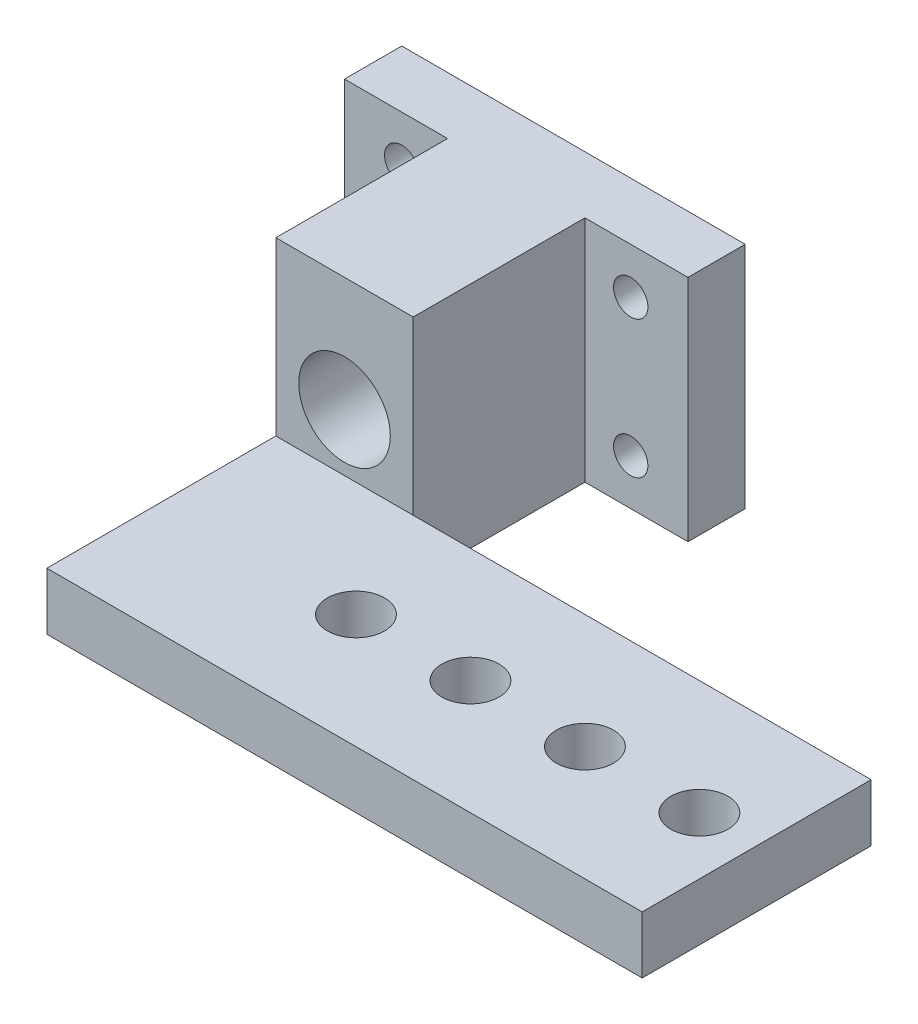
ISO-10303-21;
HEADER;
FILE_DESCRIPTION(('STEP AP214'),'2;1');
FILE_NAME('part.step','',(''),(''),'','','');
FILE_SCHEMA(('AUTOMOTIVE_DESIGN { 1 0 10303 214 1 1 1 1 }'));
ENDSEC;
DATA;
#1=APPLICATION_CONTEXT('core data for automotive mechanical design processes');
#2=APPLICATION_PROTOCOL_DEFINITION('international standard','automotive_design',2000,#1);
#3=PRODUCT_CONTEXT('',#1,'mechanical');
#4=PRODUCT('Part','Part','',(#3));
#5=PRODUCT_RELATED_PRODUCT_CATEGORY('part','',(#4));
#6=PRODUCT_DEFINITION_FORMATION('','',#4);
#7=PRODUCT_DEFINITION_CONTEXT('part definition',#1,'design');
#8=PRODUCT_DEFINITION('design','',#6,#7);
#9=PRODUCT_DEFINITION_SHAPE('','',#8);
#10=(LENGTH_UNIT() NAMED_UNIT(*) SI_UNIT(.MILLI.,.METRE.));
#11=(NAMED_UNIT(*) PLANE_ANGLE_UNIT() SI_UNIT($,.RADIAN.));
#12=(NAMED_UNIT(*) SI_UNIT($,.STERADIAN.) SOLID_ANGLE_UNIT());
#13=UNCERTAINTY_MEASURE_WITH_UNIT(LENGTH_MEASURE(1.E-05),#10,'distance_accuracy_value','');
#14=(GEOMETRIC_REPRESENTATION_CONTEXT(3) GLOBAL_UNCERTAINTY_ASSIGNED_CONTEXT((#13)) GLOBAL_UNIT_ASSIGNED_CONTEXT((#10,
#11,#12)) REPRESENTATION_CONTEXT('',''));
#15=CARTESIAN_POINT('',(0.,0.,0.));
#16=DIRECTION('',(0.,0.,1.));
#17=DIRECTION('',(1.,0.,0.));
#18=AXIS2_PLACEMENT_3D('',#15,#16,#17);
#19=CARTESIAN_POINT('',(21.,0.,5.));
#20=DIRECTION('',(-1.,0.,0.));
#21=DIRECTION('',(0.,-1.,0.));
#22=AXIS2_PLACEMENT_3D('',#19,#20,#21);
#23=PLANE('',#22);
#24=DIRECTION('',(0.,1.,0.));
#25=VECTOR('',#24,1.);
#26=CARTESIAN_POINT('',(21.,-15.,20.));
#27=LINE('',#26,#25);
#28=CARTESIAN_POINT('',(21.,-20.,20.));
#29=VERTEX_POINT('',#28);
#30=CARTESIAN_POINT('',(21.,-15.,20.));
#31=VERTEX_POINT('',#30);
#32=EDGE_CURVE('E146',#29,#31,#27,.T.);
#33=ORIENTED_EDGE('',*,*,#32,.F.);
#34=DIRECTION('',(0.,0.,1.));
#35=VECTOR('',#34,1.);
#36=CARTESIAN_POINT('',(21.,-20.,5.));
#37=LINE('',#36,#35);
#38=CARTESIAN_POINT('',(21.,-20.,5.));
#39=VERTEX_POINT('',#38);
#40=EDGE_CURVE('E178',#39,#29,#37,.T.);
#41=ORIENTED_EDGE('',*,*,#40,.F.);
#42=DIRECTION('',(0.,-1.,0.));
#43=VECTOR('',#42,1.);
#44=CARTESIAN_POINT('',(21.,0.,5.));
#45=LINE('',#44,#43);
#46=CARTESIAN_POINT('',(21.,0.,5.));
#47=VERTEX_POINT('',#46);
#48=EDGE_CURVE('E187',#47,#39,#45,.T.);
#49=ORIENTED_EDGE('',*,*,#48,.F.);
#50=DIRECTION('',(0.,0.,1.));
#51=VECTOR('',#50,1.);
#52=CARTESIAN_POINT('',(21.,0.,5.));
#53=LINE('',#52,#51);
#54=CARTESIAN_POINT('',(21.,0.,20.));
#55=VERTEX_POINT('',#54);
#56=EDGE_CURVE('E192',#47,#55,#53,.T.);
#57=ORIENTED_EDGE('',*,*,#56,.T.);
#58=DIRECTION('',(0.,-1.,0.));
#59=VECTOR('',#58,1.);
#60=CARTESIAN_POINT('',(21.,0.,20.));
#61=LINE('',#60,#59);
#62=EDGE_CURVE('E167',#55,#31,#61,.T.);
#63=ORIENTED_EDGE('',*,*,#62,.T.);
#64=EDGE_LOOP('',(#33,#41,#49,#57,#63));
#65=FACE_BOUND('',#64,.T.);
#66=ADVANCED_FACE('F33',(#65),#23,.F.);
#67=CARTESIAN_POINT('',(0.,0.,20.));
#68=DIRECTION('',(1.,0.,0.));
#69=DIRECTION('',(0.,1.,0.));
#70=AXIS2_PLACEMENT_3D('',#67,#68,#69);
#71=PLANE('',#70);
#72=DIRECTION('',(0.,-1.,0.));
#73=VECTOR('',#72,1.);
#74=CARTESIAN_POINT('',(0.,0.,5.));
#75=LINE('',#74,#73);
#76=CARTESIAN_POINT('',(0.,0.,5.));
#77=VERTEX_POINT('',#76);
#78=CARTESIAN_POINT('',(0.,-20.,5.));
#79=VERTEX_POINT('',#78);
#80=EDGE_CURVE('E168',#77,#79,#75,.T.);
#81=ORIENTED_EDGE('',*,*,#80,.F.);
#82=DIRECTION('',(0.,0.,-1.));
#83=VECTOR('',#82,1.);
#84=CARTESIAN_POINT('',(0.,0.,20.));
#85=LINE('',#84,#83);
#86=CARTESIAN_POINT('',(0.,0.,0.));
#87=VERTEX_POINT('',#86);
#88=EDGE_CURVE('E225',#77,#87,#85,.T.);
#89=ORIENTED_EDGE('',*,*,#88,.T.);
#90=DIRECTION('',(0.,-1.,0.));
#91=VECTOR('',#90,1.);
#92=CARTESIAN_POINT('',(0.,0.,0.));
#93=LINE('',#92,#91);
#94=CARTESIAN_POINT('',(0.,-20.,0.));
#95=VERTEX_POINT('',#94);
#96=EDGE_CURVE('E221',#87,#95,#93,.T.);
#97=ORIENTED_EDGE('',*,*,#96,.T.);
#98=DIRECTION('',(0.,0.,-1.));
#99=VECTOR('',#98,1.);
#100=CARTESIAN_POINT('',(0.,-20.,20.));
#101=LINE('',#100,#99);
#102=EDGE_CURVE('E11',#79,#95,#101,.T.);
#103=ORIENTED_EDGE('',*,*,#102,.F.);
#104=EDGE_LOOP('',(#81,#89,#97,#103));
#105=FACE_BOUND('',#104,.T.);
#106=ADVANCED_FACE('F35',(#105),#71,.F.);
#107=CARTESIAN_POINT('',(5.,-4.,20.));
#108=DIRECTION('',(0.,0.,-1.));
#109=DIRECTION('',(-1.,0.,0.));
#110=AXIS2_PLACEMENT_3D('',#107,#108,#109);
#111=CYLINDRICAL_SURFACE('',#110,1.5);
#112=CARTESIAN_POINT('',(5.,-4.,0.));
#113=DIRECTION('',(0.,0.,1.));
#114=DIRECTION('',(1.,0.,0.));
#115=AXIS2_PLACEMENT_3D('',#112,#113,#114);
#116=CIRCLE('',#115,1.5);
#117=CARTESIAN_POINT('',(6.5,-4.,0.));
#118=VERTEX_POINT('',#117);
#119=EDGE_CURVE('E218',#118,#118,#116,.T.);
#120=ORIENTED_EDGE('',*,*,#119,.F.);
#121=EDGE_LOOP('',(#120));
#122=FACE_BOUND('',#121,.T.);
#123=CARTESIAN_POINT('',(5.,-4.,5.));
#124=DIRECTION('',(0.,0.,1.));
#125=DIRECTION('',(1.,0.,0.));
#126=AXIS2_PLACEMENT_3D('',#123,#124,#125);
#127=CIRCLE('',#126,1.5);
#128=CARTESIAN_POINT('',(6.5,-4.,5.));
#129=VERTEX_POINT('',#128);
#130=EDGE_CURVE('E197',#129,#129,#127,.T.);
#131=ORIENTED_EDGE('',*,*,#130,.T.);
#132=EDGE_LOOP('',(#131));
#133=FACE_BOUND('',#132,.T.);
#134=ADVANCED_FACE('F305',(#122,#133),#111,.F.);
#135=CARTESIAN_POINT('',(5.,-16.,20.));
#136=DIRECTION('',(0.,0.,-1.));
#137=DIRECTION('',(-1.,0.,0.));
#138=AXIS2_PLACEMENT_3D('',#135,#136,#137);
#139=CYLINDRICAL_SURFACE('',#138,1.5);
#140=CARTESIAN_POINT('',(5.,-16.,0.));
#141=DIRECTION('',(0.,0.,1.));
#142=DIRECTION('',(-1.,0.,0.));
#143=AXIS2_PLACEMENT_3D('',#140,#141,#142);
#144=CIRCLE('',#143,1.5);
#145=CARTESIAN_POINT('',(3.5,-16.,0.));
#146=VERTEX_POINT('',#145);
#147=EDGE_CURVE('E207',#146,#146,#144,.T.);
#148=ORIENTED_EDGE('',*,*,#147,.F.);
#149=EDGE_LOOP('',(#148));
#150=FACE_BOUND('',#149,.T.);
#151=CARTESIAN_POINT('',(5.,-16.,5.));
#152=DIRECTION('',(0.,0.,1.));
#153=DIRECTION('',(1.,0.,0.));
#154=AXIS2_PLACEMENT_3D('',#151,#152,#153);
#155=CIRCLE('',#154,1.5);
#156=CARTESIAN_POINT('',(6.5,-16.,5.));
#157=VERTEX_POINT('',#156);
#158=EDGE_CURVE('E182',#157,#157,#155,.T.);
#159=ORIENTED_EDGE('',*,*,#158,.T.);
#160=EDGE_LOOP('',(#159));
#161=FACE_BOUND('',#160,.T.);
#162=ADVANCED_FACE('F243',(#150,#161),#139,.F.);
#163=CARTESIAN_POINT('',(0.,0.,20.));
#164=DIRECTION('',(0.,0.,1.));
#165=DIRECTION('',(1.,0.,0.));
#166=AXIS2_PLACEMENT_3D('',#163,#164,#165);
#167=PLANE('',#166);
#168=DIRECTION('',(-1.,0.,0.));
#169=VECTOR('',#168,1.);
#170=CARTESIAN_POINT('',(9.,-15.,20.));
#171=LINE('',#170,#169);
#172=CARTESIAN_POINT('',(9.,-15.,20.));
#173=VERTEX_POINT('',#172);
#174=EDGE_CURVE('E159',#31,#173,#171,.T.);
#175=ORIENTED_EDGE('',*,*,#174,.F.);
#176=ORIENTED_EDGE('',*,*,#62,.F.);
#177=DIRECTION('',(-1.,0.,0.));
#178=VECTOR('',#177,1.);
#179=CARTESIAN_POINT('',(0.,0.,20.));
#180=LINE('',#179,#178);
#181=CARTESIAN_POINT('',(9.,0.,20.));
#182=VERTEX_POINT('',#181);
#183=EDGE_CURVE('E222',#55,#182,#180,.T.);
#184=ORIENTED_EDGE('',*,*,#183,.T.);
#185=DIRECTION('',(0.,1.,0.));
#186=VECTOR('',#185,1.);
#187=CARTESIAN_POINT('',(9.,0.,20.));
#188=LINE('',#187,#186);
#189=EDGE_CURVE('E171',#173,#182,#188,.T.);
#190=ORIENTED_EDGE('',*,*,#189,.F.);
#191=EDGE_LOOP('',(#175,#176,#184,#190));
#192=FACE_BOUND('',#191,.T.);
#193=CARTESIAN_POINT('',(15.,-10.,20.));
#194=DIRECTION('',(0.,0.,1.));
#195=DIRECTION('',(1.,0.,0.));
#196=AXIS2_PLACEMENT_3D('',#193,#194,#195);
#197=CIRCLE('',#196,4.);
#198=CARTESIAN_POINT('',(19.,-10.,20.));
#199=VERTEX_POINT('',#198);
#200=EDGE_CURVE('E204',#199,#199,#197,.T.);
#201=ORIENTED_EDGE('',*,*,#200,.F.);
#202=EDGE_LOOP('',(#201));
#203=FACE_BOUND('',#202,.T.);
#204=ADVANCED_FACE('F284',(#192,#203),#167,.T.);
#205=CARTESIAN_POINT('',(0.,0.,0.));
#206=DIRECTION('',(0.,0.,1.));
#207=DIRECTION('',(1.,0.,0.));
#208=AXIS2_PLACEMENT_3D('',#205,#206,#207);
#209=PLANE('',#208);
#210=ORIENTED_EDGE('',*,*,#96,.F.);
#211=DIRECTION('',(-1.,0.,0.));
#212=VECTOR('',#211,1.);
#213=CARTESIAN_POINT('',(0.,0.,0.));
#214=LINE('',#213,#212);
#215=CARTESIAN_POINT('',(30.,0.,0.));
#216=VERTEX_POINT('',#215);
#217=EDGE_CURVE('E226',#216,#87,#214,.T.);
#218=ORIENTED_EDGE('',*,*,#217,.F.);
#219=DIRECTION('',(0.,1.,0.));
#220=VECTOR('',#219,1.);
#221=CARTESIAN_POINT('',(30.,0.,0.));
#222=LINE('',#221,#220);
#223=CARTESIAN_POINT('',(30.,-20.,0.));
#224=VERTEX_POINT('',#223);
#225=EDGE_CURVE('E232',#224,#216,#222,.T.);
#226=ORIENTED_EDGE('',*,*,#225,.F.);
#227=DIRECTION('',(1.,0.,0.));
#228=VECTOR('',#227,1.);
#229=CARTESIAN_POINT('',(0.,-20.,0.));
#230=LINE('',#229,#228);
#231=EDGE_CURVE('E229',#95,#224,#230,.T.);
#232=ORIENTED_EDGE('',*,*,#231,.F.);
#233=EDGE_LOOP('',(#210,#218,#226,#232));
#234=FACE_BOUND('',#233,.T.);
#235=ORIENTED_EDGE('',*,*,#119,.T.);
#236=EDGE_LOOP('',(#235));
#237=FACE_BOUND('',#236,.T.);
#238=CARTESIAN_POINT('',(25.,-4.,0.));
#239=DIRECTION('',(0.,0.,1.));
#240=DIRECTION('',(-1.,0.,0.));
#241=AXIS2_PLACEMENT_3D('',#238,#239,#240);
#242=CIRCLE('',#241,1.5);
#243=CARTESIAN_POINT('',(23.5,-4.,0.));
#244=VERTEX_POINT('',#243);
#245=EDGE_CURVE('E215',#244,#244,#242,.T.);
#246=ORIENTED_EDGE('',*,*,#245,.T.);
#247=EDGE_LOOP('',(#246));
#248=FACE_BOUND('',#247,.T.);
#249=CARTESIAN_POINT('',(25.,-16.,0.));
#250=DIRECTION('',(0.,0.,1.));
#251=DIRECTION('',(1.,0.,0.));
#252=AXIS2_PLACEMENT_3D('',#249,#250,#251);
#253=CIRCLE('',#252,1.5);
#254=CARTESIAN_POINT('',(26.5,-16.,0.));
#255=VERTEX_POINT('',#254);
#256=EDGE_CURVE('E212',#255,#255,#253,.T.);
#257=ORIENTED_EDGE('',*,*,#256,.T.);
#258=EDGE_LOOP('',(#257));
#259=FACE_BOUND('',#258,.T.);
#260=ORIENTED_EDGE('',*,*,#147,.T.);
#261=EDGE_LOOP('',(#260));
#262=FACE_BOUND('',#261,.T.);
#263=CARTESIAN_POINT('',(15.,-10.,0.));
#264=DIRECTION('',(0.,0.,1.));
#265=DIRECTION('',(1.,0.,0.));
#266=AXIS2_PLACEMENT_3D('',#263,#264,#265);
#267=CIRCLE('',#266,4.);
#268=CARTESIAN_POINT('',(19.,-10.,0.));
#269=VERTEX_POINT('',#268);
#270=EDGE_CURVE('E203',#269,#269,#267,.T.);
#271=ORIENTED_EDGE('',*,*,#270,.T.);
#272=EDGE_LOOP('',(#271));
#273=FACE_BOUND('',#272,.T.);
#274=ADVANCED_FACE('F261',(#234,#237,#248,#259,#262,#273),#209,.F.);
#275=CARTESIAN_POINT('',(0.,-20.,20.));
#276=DIRECTION('',(0.,1.,0.));
#277=DIRECTION('',(0.,0.,1.));
#278=AXIS2_PLACEMENT_3D('',#275,#276,#277);
#279=PLANE('',#278);
#280=CARTESIAN_POINT('',(26.,-20.,30.));
#281=DIRECTION('',(0.,1.,0.));
#282=DIRECTION('',(0.,0.,1.));
#283=AXIS2_PLACEMENT_3D('',#280,#281,#282);
#284=CIRCLE('',#283,2.5);
#285=CARTESIAN_POINT('',(26.,-20.,32.5));
#286=VERTEX_POINT('',#285);
#287=EDGE_CURVE('E148',#286,#286,#284,.T.);
#288=ORIENTED_EDGE('',*,*,#287,.T.);
#289=EDGE_LOOP('',(#288));
#290=FACE_BOUND('',#289,.T.);
#291=CARTESIAN_POINT('',(36.,-20.,30.));
#292=DIRECTION('',(0.,1.,0.));
#293=DIRECTION('',(0.,0.,1.));
#294=AXIS2_PLACEMENT_3D('',#291,#292,#293);
#295=CIRCLE('',#294,2.49999999999999);
#296=CARTESIAN_POINT('',(36.,-20.,32.5));
#297=VERTEX_POINT('',#296);
#298=EDGE_CURVE('E336',#297,#297,#295,.T.);
#299=ORIENTED_EDGE('',*,*,#298,.T.);
#300=EDGE_LOOP('',(#299));
#301=FACE_BOUND('',#300,.T.);
#302=CARTESIAN_POINT('',(46.,-20.,30.));
#303=DIRECTION('',(0.,1.,0.));
#304=DIRECTION('',(0.,0.,1.));
#305=AXIS2_PLACEMENT_3D('',#302,#303,#304);
#306=CIRCLE('',#305,2.5);
#307=CARTESIAN_POINT('',(46.,-20.,32.5));
#308=VERTEX_POINT('',#307);
#309=EDGE_CURVE('E340',#308,#308,#306,.T.);
#310=ORIENTED_EDGE('',*,*,#309,.T.);
#311=EDGE_LOOP('',(#310));
#312=FACE_BOUND('',#311,.T.);
#313=CARTESIAN_POINT('',(56.,-20.,30.));
#314=DIRECTION('',(0.,1.,0.));
#315=DIRECTION('',(0.,0.,1.));
#316=AXIS2_PLACEMENT_3D('',#313,#314,#315);
#317=CIRCLE('',#316,2.5);
#318=CARTESIAN_POINT('',(56.,-20.,32.5));
#319=VERTEX_POINT('',#318);
#320=EDGE_CURVE('E343',#319,#319,#317,.T.);
#321=ORIENTED_EDGE('',*,*,#320,.T.);
#322=EDGE_LOOP('',(#321));
#323=FACE_BOUND('',#322,.T.);
#324=ORIENTED_EDGE('',*,*,#40,.T.);
#325=DIRECTION('',(-1.,0.,0.));
#326=VECTOR('',#325,1.);
#327=CARTESIAN_POINT('',(61.,-20.,20.));
#328=LINE('',#327,#326);
#329=CARTESIAN_POINT('',(61.,-20.,20.));
#330=VERTEX_POINT('',#329);
#331=EDGE_CURVE('E137',#330,#29,#328,.T.);
#332=ORIENTED_EDGE('',*,*,#331,.F.);
#333=DIRECTION('',(0.,0.,-1.));
#334=VECTOR('',#333,1.);
#335=CARTESIAN_POINT('',(61.,-20.,40.));
#336=LINE('',#335,#334);
#337=CARTESIAN_POINT('',(61.,-20.,40.));
#338=VERTEX_POINT('',#337);
#339=EDGE_CURVE('E134',#338,#330,#336,.T.);
#340=ORIENTED_EDGE('',*,*,#339,.F.);
#341=DIRECTION('',(1.,0.,0.));
#342=VECTOR('',#341,1.);
#343=CARTESIAN_POINT('',(9.,-20.,40.));
#344=LINE('',#343,#342);
#345=CARTESIAN_POINT('',(9.,-20.,40.));
#346=VERTEX_POINT('',#345);
#347=EDGE_CURVE('E122',#346,#338,#344,.T.);
#348=ORIENTED_EDGE('',*,*,#347,.F.);
#349=DIRECTION('',(0.,0.,1.));
#350=VECTOR('',#349,1.);
#351=CARTESIAN_POINT('',(9.,-20.,5.));
#352=LINE('',#351,#350);
#353=CARTESIAN_POINT('',(9.,-20.,5.));
#354=VERTEX_POINT('',#353);
#355=EDGE_CURVE('E176',#354,#346,#352,.T.);
#356=ORIENTED_EDGE('',*,*,#355,.F.);
#357=DIRECTION('',(1.,0.,0.));
#358=VECTOR('',#357,1.);
#359=CARTESIAN_POINT('',(0.,-20.,5.));
#360=LINE('',#359,#358);
#361=EDGE_CURVE('E170',#79,#354,#360,.T.);
#362=ORIENTED_EDGE('',*,*,#361,.F.);
#363=ORIENTED_EDGE('',*,*,#102,.T.);
#364=ORIENTED_EDGE('',*,*,#231,.T.);
#365=DIRECTION('',(0.,0.,-1.));
#366=VECTOR('',#365,1.);
#367=CARTESIAN_POINT('',(30.,-20.,20.));
#368=LINE('',#367,#366);
#369=CARTESIAN_POINT('',(30.,-20.,5.));
#370=VERTEX_POINT('',#369);
#371=EDGE_CURVE('E42',#370,#224,#368,.T.);
#372=ORIENTED_EDGE('',*,*,#371,.F.);
#373=DIRECTION('',(1.,0.,0.));
#374=VECTOR('',#373,1.);
#375=CARTESIAN_POINT('',(30.,-20.,5.));
#376=LINE('',#375,#374);
#377=EDGE_CURVE('E190',#39,#370,#376,.T.);
#378=ORIENTED_EDGE('',*,*,#377,.F.);
#379=EDGE_LOOP('',(#324,#332,#340,#348,#356,#362,#363,#364,#372,#378));
#380=FACE_BOUND('',#379,.T.);
#381=ADVANCED_FACE('F136',(#290,#301,#312,#323,#380),#279,.F.);
#382=CARTESIAN_POINT('',(30.,0.,20.));
#383=DIRECTION('',(-1.,0.,0.));
#384=DIRECTION('',(0.,-1.,0.));
#385=AXIS2_PLACEMENT_3D('',#382,#383,#384);
#386=PLANE('',#385);
#387=DIRECTION('',(0.,0.,-1.));
#388=VECTOR('',#387,1.);
#389=CARTESIAN_POINT('',(30.,0.,20.));
#390=LINE('',#389,#388);
#391=CARTESIAN_POINT('',(30.,0.,5.));
#392=VERTEX_POINT('',#391);
#393=EDGE_CURVE('E238',#392,#216,#390,.T.);
#394=ORIENTED_EDGE('',*,*,#393,.F.);
#395=DIRECTION('',(0.,1.,0.));
#396=VECTOR('',#395,1.);
#397=CARTESIAN_POINT('',(30.,0.,5.));
#398=LINE('',#397,#396);
#399=EDGE_CURVE('E58',#370,#392,#398,.T.);
#400=ORIENTED_EDGE('',*,*,#399,.F.);
#401=ORIENTED_EDGE('',*,*,#371,.T.);
#402=ORIENTED_EDGE('',*,*,#225,.T.);
#403=EDGE_LOOP('',(#394,#400,#401,#402));
#404=FACE_BOUND('',#403,.T.);
#405=ADVANCED_FACE('F268',(#404),#386,.F.);
#406=CARTESIAN_POINT('',(0.,0.,20.));
#407=DIRECTION('',(0.,-1.,0.));
#408=DIRECTION('',(0.,0.,-1.));
#409=AXIS2_PLACEMENT_3D('',#406,#407,#408);
#410=PLANE('',#409);
#411=DIRECTION('',(-1.,0.,0.));
#412=VECTOR('',#411,1.);
#413=CARTESIAN_POINT('',(0.,0.,5.));
#414=LINE('',#413,#412);
#415=CARTESIAN_POINT('',(9.,0.,5.));
#416=VERTEX_POINT('',#415);
#417=EDGE_CURVE('E174',#416,#77,#414,.T.);
#418=ORIENTED_EDGE('',*,*,#417,.F.);
#419=DIRECTION('',(0.,0.,1.));
#420=VECTOR('',#419,1.);
#421=CARTESIAN_POINT('',(9.,0.,5.));
#422=LINE('',#421,#420);
#423=EDGE_CURVE('E179',#416,#182,#422,.T.);
#424=ORIENTED_EDGE('',*,*,#423,.T.);
#425=ORIENTED_EDGE('',*,*,#183,.F.);
#426=ORIENTED_EDGE('',*,*,#56,.F.);
#427=DIRECTION('',(-1.,0.,0.));
#428=VECTOR('',#427,1.);
#429=CARTESIAN_POINT('',(30.,0.,5.));
#430=LINE('',#429,#428);
#431=EDGE_CURVE('E185',#392,#47,#430,.T.);
#432=ORIENTED_EDGE('',*,*,#431,.F.);
#433=ORIENTED_EDGE('',*,*,#393,.T.);
#434=ORIENTED_EDGE('',*,*,#217,.T.);
#435=ORIENTED_EDGE('',*,*,#88,.F.);
#436=EDGE_LOOP('',(#418,#424,#425,#426,#432,#433,#434,#435));
#437=FACE_BOUND('',#436,.T.);
#438=ADVANCED_FACE('F270',(#437),#410,.F.);
#439=CARTESIAN_POINT('',(25.,-4.,20.));
#440=DIRECTION('',(0.,0.,-1.));
#441=DIRECTION('',(-1.,0.,0.));
#442=AXIS2_PLACEMENT_3D('',#439,#440,#441);
#443=CYLINDRICAL_SURFACE('',#442,1.5);
#444=CARTESIAN_POINT('',(25.,-4.,5.));
#445=DIRECTION('',(0.,0.,-1.));
#446=DIRECTION('',(-1.,0.,0.));
#447=AXIS2_PLACEMENT_3D('',#444,#445,#446);
#448=CIRCLE('',#447,1.5);
#449=CARTESIAN_POINT('',(23.5,-4.,5.));
#450=VERTEX_POINT('',#449);
#451=EDGE_CURVE('E200',#450,#450,#448,.T.);
#452=ORIENTED_EDGE('',*,*,#451,.F.);
#453=EDGE_LOOP('',(#452));
#454=FACE_BOUND('',#453,.T.);
#455=ORIENTED_EDGE('',*,*,#245,.F.);
#456=EDGE_LOOP('',(#455));
#457=FACE_BOUND('',#456,.T.);
#458=ADVANCED_FACE('F312',(#454,#457),#443,.F.);
#459=CARTESIAN_POINT('',(25.,-16.,20.));
#460=DIRECTION('',(0.,0.,-1.));
#461=DIRECTION('',(-1.,0.,0.));
#462=AXIS2_PLACEMENT_3D('',#459,#460,#461);
#463=CYLINDRICAL_SURFACE('',#462,1.5);
#464=CARTESIAN_POINT('',(25.,-16.,5.));
#465=DIRECTION('',(0.,0.,-1.));
#466=DIRECTION('',(-1.,0.,0.));
#467=AXIS2_PLACEMENT_3D('',#464,#465,#466);
#468=CIRCLE('',#467,1.5);
#469=CARTESIAN_POINT('',(23.5,-16.,5.));
#470=VERTEX_POINT('',#469);
#471=EDGE_CURVE('E37',#470,#470,#468,.T.);
#472=ORIENTED_EDGE('',*,*,#471,.F.);
#473=EDGE_LOOP('',(#472));
#474=FACE_BOUND('',#473,.T.);
#475=ORIENTED_EDGE('',*,*,#256,.F.);
#476=EDGE_LOOP('',(#475));
#477=FACE_BOUND('',#476,.T.);
#478=ADVANCED_FACE('F295',(#474,#477),#463,.F.);
#479=CARTESIAN_POINT('',(15.,-10.,20.));
#480=DIRECTION('',(0.,0.,-1.));
#481=DIRECTION('',(-1.,0.,0.));
#482=AXIS2_PLACEMENT_3D('',#479,#480,#481);
#483=CYLINDRICAL_SURFACE('',#482,4.);
#484=ORIENTED_EDGE('',*,*,#200,.T.);
#485=EDGE_LOOP('',(#484));
#486=FACE_BOUND('',#485,.T.);
#487=ORIENTED_EDGE('',*,*,#270,.F.);
#488=EDGE_LOOP('',(#487));
#489=FACE_BOUND('',#488,.T.);
#490=ADVANCED_FACE('F288',(#486,#489),#483,.F.);
#491=CARTESIAN_POINT('',(9.,0.,5.));
#492=DIRECTION('',(1.,0.,0.));
#493=DIRECTION('',(0.,1.,0.));
#494=AXIS2_PLACEMENT_3D('',#491,#492,#493);
#495=PLANE('',#494);
#496=ORIENTED_EDGE('',*,*,#355,.T.);
#497=DIRECTION('',(0.,-1.,0.));
#498=VECTOR('',#497,1.);
#499=CARTESIAN_POINT('',(9.,-15.,40.));
#500=LINE('',#499,#498);
#501=CARTESIAN_POINT('',(9.,-15.,40.));
#502=VERTEX_POINT('',#501);
#503=EDGE_CURVE('E128',#502,#346,#500,.T.);
#504=ORIENTED_EDGE('',*,*,#503,.F.);
#505=DIRECTION('',(0.,0.,-1.));
#506=VECTOR('',#505,1.);
#507=CARTESIAN_POINT('',(9.,-15.,40.));
#508=LINE('',#507,#506);
#509=EDGE_CURVE('E162',#502,#173,#508,.T.);
#510=ORIENTED_EDGE('',*,*,#509,.T.);
#511=ORIENTED_EDGE('',*,*,#189,.T.);
#512=ORIENTED_EDGE('',*,*,#423,.F.);
#513=DIRECTION('',(0.,1.,0.));
#514=VECTOR('',#513,1.);
#515=CARTESIAN_POINT('',(9.,0.,5.));
#516=LINE('',#515,#514);
#517=EDGE_CURVE('E50',#354,#416,#516,.T.);
#518=ORIENTED_EDGE('',*,*,#517,.F.);
#519=EDGE_LOOP('',(#496,#504,#510,#511,#512,#518));
#520=FACE_BOUND('',#519,.T.);
#521=ADVANCED_FACE('F248',(#520),#495,.F.);
#522=CARTESIAN_POINT('',(0.,0.,5.));
#523=DIRECTION('',(0.,0.,1.));
#524=DIRECTION('',(1.,0.,0.));
#525=AXIS2_PLACEMENT_3D('',#522,#523,#524);
#526=PLANE('',#525);
#527=ORIENTED_EDGE('',*,*,#130,.F.);
#528=EDGE_LOOP('',(#527));
#529=FACE_BOUND('',#528,.T.);
#530=ORIENTED_EDGE('',*,*,#158,.F.);
#531=EDGE_LOOP('',(#530));
#532=FACE_BOUND('',#531,.T.);
#533=ORIENTED_EDGE('',*,*,#80,.T.);
#534=ORIENTED_EDGE('',*,*,#361,.T.);
#535=ORIENTED_EDGE('',*,*,#517,.T.);
#536=ORIENTED_EDGE('',*,*,#417,.T.);
#537=EDGE_LOOP('',(#533,#534,#535,#536));
#538=FACE_BOUND('',#537,.T.);
#539=ADVANCED_FACE('F245',(#529,#532,#538),#526,.T.);
#540=CARTESIAN_POINT('',(0.,0.,5.));
#541=DIRECTION('',(0.,0.,-1.));
#542=DIRECTION('',(-1.,0.,0.));
#543=AXIS2_PLACEMENT_3D('',#540,#541,#542);
#544=PLANE('',#543);
#545=ORIENTED_EDGE('',*,*,#451,.T.);
#546=EDGE_LOOP('',(#545));
#547=FACE_BOUND('',#546,.T.);
#548=ORIENTED_EDGE('',*,*,#471,.T.);
#549=EDGE_LOOP('',(#548));
#550=FACE_BOUND('',#549,.T.);
#551=ORIENTED_EDGE('',*,*,#399,.T.);
#552=ORIENTED_EDGE('',*,*,#431,.T.);
#553=ORIENTED_EDGE('',*,*,#48,.T.);
#554=ORIENTED_EDGE('',*,*,#377,.T.);
#555=EDGE_LOOP('',(#551,#552,#553,#554));
#556=FACE_BOUND('',#555,.T.);
#557=ADVANCED_FACE('F247',(#547,#550,#556),#544,.F.);
#558=CARTESIAN_POINT('',(9.,-15.,40.));
#559=DIRECTION('',(0.,-1.,0.));
#560=DIRECTION('',(0.,0.,-1.));
#561=AXIS2_PLACEMENT_3D('',#558,#559,#560);
#562=PLANE('',#561);
#563=CARTESIAN_POINT('',(26.,-15.,30.));
#564=DIRECTION('',(0.,1.,0.));
#565=DIRECTION('',(0.,0.,1.));
#566=AXIS2_PLACEMENT_3D('',#563,#564,#565);
#567=CIRCLE('',#566,2.5);
#568=CARTESIAN_POINT('',(26.,-15.,32.5));
#569=VERTEX_POINT('',#568);
#570=EDGE_CURVE('E345',#569,#569,#567,.T.);
#571=ORIENTED_EDGE('',*,*,#570,.F.);
#572=EDGE_LOOP('',(#571));
#573=FACE_BOUND('',#572,.T.);
#574=CARTESIAN_POINT('',(36.,-15.,30.));
#575=DIRECTION('',(0.,1.,0.));
#576=DIRECTION('',(0.,0.,1.));
#577=AXIS2_PLACEMENT_3D('',#574,#575,#576);
#578=CIRCLE('',#577,2.49999999999999);
#579=CARTESIAN_POINT('',(36.,-15.,32.5));
#580=VERTEX_POINT('',#579);
#581=EDGE_CURVE('E349',#580,#580,#578,.T.);
#582=ORIENTED_EDGE('',*,*,#581,.F.);
#583=EDGE_LOOP('',(#582));
#584=FACE_BOUND('',#583,.T.);
#585=CARTESIAN_POINT('',(46.,-15.,30.));
#586=DIRECTION('',(0.,1.,0.));
#587=DIRECTION('',(0.,0.,1.));
#588=AXIS2_PLACEMENT_3D('',#585,#586,#587);
#589=CIRCLE('',#588,2.5);
#590=CARTESIAN_POINT('',(46.,-15.,32.5));
#591=VERTEX_POINT('',#590);
#592=EDGE_CURVE('E355',#591,#591,#589,.T.);
#593=ORIENTED_EDGE('',*,*,#592,.F.);
#594=EDGE_LOOP('',(#593));
#595=FACE_BOUND('',#594,.T.);
#596=CARTESIAN_POINT('',(56.,-15.,30.));
#597=DIRECTION('',(0.,1.,0.));
#598=DIRECTION('',(0.,0.,1.));
#599=AXIS2_PLACEMENT_3D('',#596,#597,#598);
#600=CIRCLE('',#599,2.5);
#601=CARTESIAN_POINT('',(56.,-15.,32.5));
#602=VERTEX_POINT('',#601);
#603=EDGE_CURVE('E352',#602,#602,#600,.T.);
#604=ORIENTED_EDGE('',*,*,#603,.F.);
#605=EDGE_LOOP('',(#604));
#606=FACE_BOUND('',#605,.T.);
#607=ORIENTED_EDGE('',*,*,#174,.T.);
#608=ORIENTED_EDGE('',*,*,#509,.F.);
#609=DIRECTION('',(-1.,0.,0.));
#610=VECTOR('',#609,1.);
#611=CARTESIAN_POINT('',(9.,-15.,40.));
#612=LINE('',#611,#610);
#613=CARTESIAN_POINT('',(61.,-15.,40.));
#614=VERTEX_POINT('',#613);
#615=EDGE_CURVE('E131',#614,#502,#612,.T.);
#616=ORIENTED_EDGE('',*,*,#615,.F.);
#617=DIRECTION('',(0.,0.,1.));
#618=VECTOR('',#617,1.);
#619=CARTESIAN_POINT('',(61.,-15.,40.));
#620=LINE('',#619,#618);
#621=CARTESIAN_POINT('',(61.,-15.,20.));
#622=VERTEX_POINT('',#621);
#623=EDGE_CURVE('E145',#622,#614,#620,.T.);
#624=ORIENTED_EDGE('',*,*,#623,.F.);
#625=DIRECTION('',(-1.,0.,0.));
#626=VECTOR('',#625,1.);
#627=CARTESIAN_POINT('',(61.,-15.,20.));
#628=LINE('',#627,#626);
#629=EDGE_CURVE('E154',#622,#31,#628,.T.);
#630=ORIENTED_EDGE('',*,*,#629,.T.);
#631=EDGE_LOOP('',(#607,#608,#616,#624,#630));
#632=FACE_BOUND('',#631,.T.);
#633=ADVANCED_FACE('F281',(#573,#584,#595,#606,#632),#562,.F.);
#634=CARTESIAN_POINT('',(0.,0.,40.));
#635=DIRECTION('',(0.,0.,1.));
#636=DIRECTION('',(1.,0.,0.));
#637=AXIS2_PLACEMENT_3D('',#634,#635,#636);
#638=PLANE('',#637);
#639=ORIENTED_EDGE('',*,*,#503,.T.);
#640=ORIENTED_EDGE('',*,*,#347,.T.);
#641=DIRECTION('',(0.,-1.,0.));
#642=VECTOR('',#641,1.);
#643=CARTESIAN_POINT('',(61.,-15.,40.));
#644=LINE('',#643,#642);
#645=EDGE_CURVE('E126',#614,#338,#644,.T.);
#646=ORIENTED_EDGE('',*,*,#645,.F.);
#647=ORIENTED_EDGE('',*,*,#615,.T.);
#648=EDGE_LOOP('',(#639,#640,#646,#647));
#649=FACE_BOUND('',#648,.T.);
#650=ADVANCED_FACE('F124',(#649),#638,.T.);
#651=CARTESIAN_POINT('',(61.,-15.,20.));
#652=DIRECTION('',(0.,0.,1.));
#653=DIRECTION('',(1.,0.,0.));
#654=AXIS2_PLACEMENT_3D('',#651,#652,#653);
#655=PLANE('',#654);
#656=ORIENTED_EDGE('',*,*,#32,.T.);
#657=ORIENTED_EDGE('',*,*,#629,.F.);
#658=DIRECTION('',(0.,1.,0.));
#659=VECTOR('',#658,1.);
#660=CARTESIAN_POINT('',(61.,-15.,20.));
#661=LINE('',#660,#659);
#662=EDGE_CURVE('E140',#330,#622,#661,.T.);
#663=ORIENTED_EDGE('',*,*,#662,.F.);
#664=ORIENTED_EDGE('',*,*,#331,.T.);
#665=EDGE_LOOP('',(#656,#657,#663,#664));
#666=FACE_BOUND('',#665,.T.);
#667=ADVANCED_FACE('F278',(#666),#655,.F.);
#668=CARTESIAN_POINT('',(61.,0.,0.));
#669=DIRECTION('',(1.,0.,0.));
#670=DIRECTION('',(0.,0.,-1.));
#671=AXIS2_PLACEMENT_3D('',#668,#669,#670);
#672=PLANE('',#671);
#673=ORIENTED_EDGE('',*,*,#645,.T.);
#674=ORIENTED_EDGE('',*,*,#339,.T.);
#675=ORIENTED_EDGE('',*,*,#662,.T.);
#676=ORIENTED_EDGE('',*,*,#623,.T.);
#677=EDGE_LOOP('',(#673,#674,#675,#676));
#678=FACE_BOUND('',#677,.T.);
#679=ADVANCED_FACE('F143',(#678),#672,.T.);
#680=CARTESIAN_POINT('',(56.,-35.,30.));
#681=DIRECTION('',(0.,1.,0.));
#682=DIRECTION('',(0.,0.,1.));
#683=AXIS2_PLACEMENT_3D('',#680,#681,#682);
#684=CYLINDRICAL_SURFACE('',#683,2.5);
#685=ORIENTED_EDGE('',*,*,#603,.T.);
#686=EDGE_LOOP('',(#685));
#687=FACE_BOUND('',#686,.T.);
#688=ORIENTED_EDGE('',*,*,#320,.F.);
#689=EDGE_LOOP('',(#688));
#690=FACE_BOUND('',#689,.T.);
#691=ADVANCED_FACE('F371',(#687,#690),#684,.F.);
#692=CARTESIAN_POINT('',(46.,-35.,30.));
#693=DIRECTION('',(0.,1.,0.));
#694=DIRECTION('',(0.,0.,1.));
#695=AXIS2_PLACEMENT_3D('',#692,#693,#694);
#696=CYLINDRICAL_SURFACE('',#695,2.5);
#697=ORIENTED_EDGE('',*,*,#592,.T.);
#698=EDGE_LOOP('',(#697));
#699=FACE_BOUND('',#698,.T.);
#700=ORIENTED_EDGE('',*,*,#309,.F.);
#701=EDGE_LOOP('',(#700));
#702=FACE_BOUND('',#701,.T.);
#703=ADVANCED_FACE('F373',(#699,#702),#696,.F.);
#704=CARTESIAN_POINT('',(36.,-35.,30.));
#705=DIRECTION('',(0.,1.,0.));
#706=DIRECTION('',(0.,0.,1.));
#707=AXIS2_PLACEMENT_3D('',#704,#705,#706);
#708=CYLINDRICAL_SURFACE('',#707,2.49999999999999);
#709=ORIENTED_EDGE('',*,*,#581,.T.);
#710=EDGE_LOOP('',(#709));
#711=FACE_BOUND('',#710,.T.);
#712=ORIENTED_EDGE('',*,*,#298,.F.);
#713=EDGE_LOOP('',(#712));
#714=FACE_BOUND('',#713,.T.);
#715=ADVANCED_FACE('F361',(#711,#714),#708,.F.);
#716=CARTESIAN_POINT('',(26.,-35.,30.));
#717=DIRECTION('',(0.,1.,0.));
#718=DIRECTION('',(0.,0.,1.));
#719=AXIS2_PLACEMENT_3D('',#716,#717,#718);
#720=CYLINDRICAL_SURFACE('',#719,2.5);
#721=ORIENTED_EDGE('',*,*,#570,.T.);
#722=EDGE_LOOP('',(#721));
#723=FACE_BOUND('',#722,.T.);
#724=ORIENTED_EDGE('',*,*,#287,.F.);
#725=EDGE_LOOP('',(#724));
#726=FACE_BOUND('',#725,.T.);
#727=ADVANCED_FACE('F429',(#723,#726),#720,.F.);
#728=CLOSED_SHELL('',(#66,#106,#134,#162,#204,#274,#381,#405,#438,#458,#478,#490,#521,#539,#557,
#633,#650,#667,#679,#691,#703,#715,#727));
#729=MANIFOLD_SOLID_BREP('B2',#728);
#730=ADVANCED_BREP_SHAPE_REPRESENTATION('',(#18,#729),#14);
#731=SHAPE_DEFINITION_REPRESENTATION(#9,#730);
ENDSEC;
END-ISO-10303-21;
